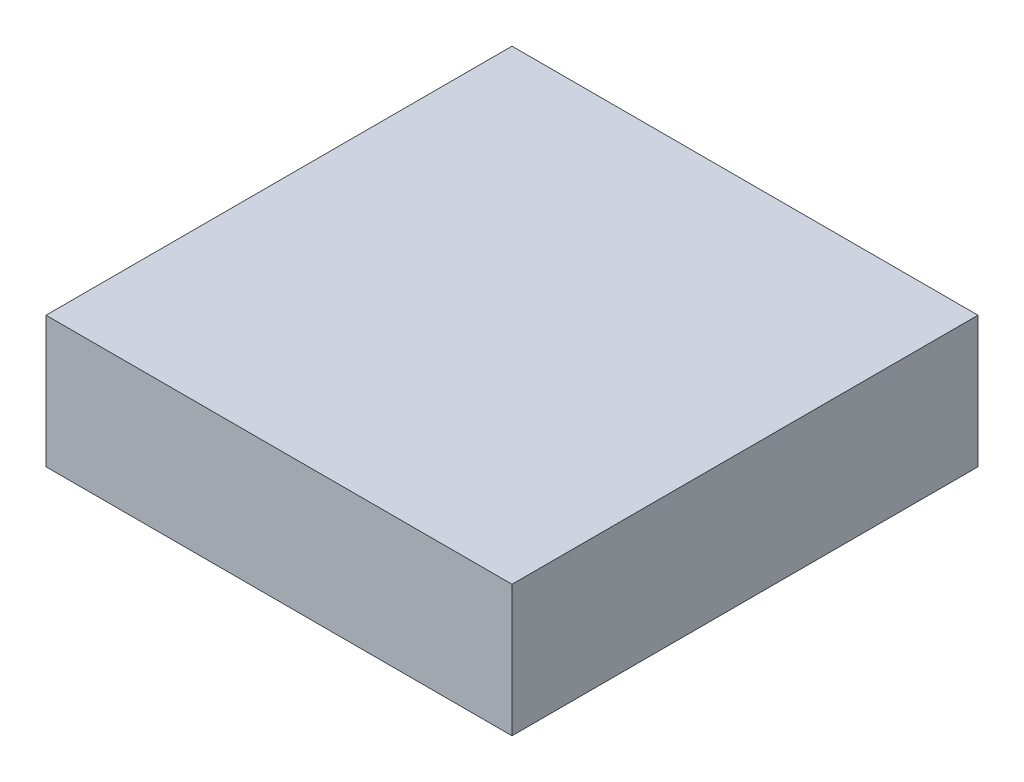
ISO-10303-21;
HEADER;
FILE_DESCRIPTION(('STEP AP214'),'2;1');
FILE_NAME('part.step','',(''),(''),'','','');
FILE_SCHEMA(('AUTOMOTIVE_DESIGN { 1 0 10303 214 1 1 1 1 }'));
ENDSEC;
DATA;
#1=APPLICATION_CONTEXT('core data for automotive mechanical design processes');
#2=APPLICATION_PROTOCOL_DEFINITION('international standard','automotive_design',2000,#1);
#3=PRODUCT_CONTEXT('',#1,'mechanical');
#4=PRODUCT('Part','Part','',(#3));
#5=PRODUCT_RELATED_PRODUCT_CATEGORY('part','',(#4));
#6=PRODUCT_DEFINITION_FORMATION('','',#4);
#7=PRODUCT_DEFINITION_CONTEXT('part definition',#1,'design');
#8=PRODUCT_DEFINITION('design','',#6,#7);
#9=PRODUCT_DEFINITION_SHAPE('','',#8);
#10=(LENGTH_UNIT() NAMED_UNIT(*) SI_UNIT(.MILLI.,.METRE.));
#11=(NAMED_UNIT(*) PLANE_ANGLE_UNIT() SI_UNIT($,.RADIAN.));
#12=(NAMED_UNIT(*) SI_UNIT($,.STERADIAN.) SOLID_ANGLE_UNIT());
#13=UNCERTAINTY_MEASURE_WITH_UNIT(LENGTH_MEASURE(1.E-05),#10,'distance_accuracy_value','');
#14=(GEOMETRIC_REPRESENTATION_CONTEXT(3) GLOBAL_UNCERTAINTY_ASSIGNED_CONTEXT((#13)) GLOBAL_UNIT_ASSIGNED_CONTEXT((#10,
#11,#12)) REPRESENTATION_CONTEXT('',''));
#15=CARTESIAN_POINT('',(0.,0.,0.));
#16=DIRECTION('',(0.,0.,1.));
#17=DIRECTION('',(1.,0.,0.));
#18=AXIS2_PLACEMENT_3D('',#15,#16,#17);
#19=CARTESIAN_POINT('',(-8.875,5.,-8.875));
#20=DIRECTION('',(1.,0.,0.));
#21=DIRECTION('',(0.,0.,-1.));
#22=AXIS2_PLACEMENT_3D('',#19,#20,#21);
#23=PLANE('',#22);
#24=DIRECTION('',(0.,0.,1.));
#25=VECTOR('',#24,1.);
#26=CARTESIAN_POINT('',(-8.875,0.,-8.875));
#27=LINE('',#26,#25);
#28=CARTESIAN_POINT('',(-8.875,0.,-8.875));
#29=VERTEX_POINT('',#28);
#30=CARTESIAN_POINT('',(-8.875,0.,8.875));
#31=VERTEX_POINT('',#30);
#32=EDGE_CURVE('E107',#29,#31,#27,.T.);
#33=ORIENTED_EDGE('',*,*,#32,.T.);
#34=DIRECTION('',(0.,-1.,0.));
#35=VECTOR('',#34,1.);
#36=CARTESIAN_POINT('',(-8.875,5.,8.875));
#37=LINE('',#36,#35);
#38=CARTESIAN_POINT('',(-8.875,5.,8.875));
#39=VERTEX_POINT('',#38);
#40=EDGE_CURVE('E11',#39,#31,#37,.T.);
#41=ORIENTED_EDGE('',*,*,#40,.F.);
#42=DIRECTION('',(0.,0.,1.));
#43=VECTOR('',#42,1.);
#44=CARTESIAN_POINT('',(-8.875,5.,-8.875));
#45=LINE('',#44,#43);
#46=CARTESIAN_POINT('',(-8.875,5.,-8.875));
#47=VERTEX_POINT('',#46);
#48=EDGE_CURVE('E91',#47,#39,#45,.T.);
#49=ORIENTED_EDGE('',*,*,#48,.F.);
#50=DIRECTION('',(0.,-1.,0.));
#51=VECTOR('',#50,1.);
#52=CARTESIAN_POINT('',(-8.875,5.,-8.875));
#53=LINE('',#52,#51);
#54=EDGE_CURVE('E103',#47,#29,#53,.T.);
#55=ORIENTED_EDGE('',*,*,#54,.T.);
#56=EDGE_LOOP('',(#33,#41,#49,#55));
#57=FACE_BOUND('',#56,.T.);
#58=ADVANCED_FACE('F39',(#57),#23,.F.);
#59=CARTESIAN_POINT('',(-8.875,5.,8.875));
#60=DIRECTION('',(0.,0.,-1.));
#61=DIRECTION('',(-1.,0.,0.));
#62=AXIS2_PLACEMENT_3D('',#59,#60,#61);
#63=PLANE('',#62);
#64=DIRECTION('',(1.,0.,0.));
#65=VECTOR('',#64,1.);
#66=CARTESIAN_POINT('',(-8.875,0.,8.875));
#67=LINE('',#66,#65);
#68=CARTESIAN_POINT('',(8.875,0.,8.875));
#69=VERTEX_POINT('',#68);
#70=EDGE_CURVE('E96',#31,#69,#67,.T.);
#71=ORIENTED_EDGE('',*,*,#70,.T.);
#72=DIRECTION('',(0.,-1.,0.));
#73=VECTOR('',#72,1.);
#74=CARTESIAN_POINT('',(8.875,5.,8.875));
#75=LINE('',#74,#73);
#76=CARTESIAN_POINT('',(8.875,5.,8.875));
#77=VERTEX_POINT('',#76);
#78=EDGE_CURVE('E48',#77,#69,#75,.T.);
#79=ORIENTED_EDGE('',*,*,#78,.F.);
#80=DIRECTION('',(1.,0.,0.));
#81=VECTOR('',#80,1.);
#82=CARTESIAN_POINT('',(-8.875,5.,8.875));
#83=LINE('',#82,#81);
#84=EDGE_CURVE('E86',#39,#77,#83,.T.);
#85=ORIENTED_EDGE('',*,*,#84,.F.);
#86=ORIENTED_EDGE('',*,*,#40,.T.);
#87=EDGE_LOOP('',(#71,#79,#85,#86));
#88=FACE_BOUND('',#87,.T.);
#89=ADVANCED_FACE('F95',(#88),#63,.F.);
#90=CARTESIAN_POINT('',(8.875,5.,-8.875));
#91=DIRECTION('',(-1.,0.,0.));
#92=DIRECTION('',(0.,0.,1.));
#93=AXIS2_PLACEMENT_3D('',#90,#91,#92);
#94=PLANE('',#93);
#95=DIRECTION('',(0.,0.,-1.));
#96=VECTOR('',#95,1.);
#97=CARTESIAN_POINT('',(8.875,0.,-8.875));
#98=LINE('',#97,#96);
#99=CARTESIAN_POINT('',(8.875,0.,-8.875));
#100=VERTEX_POINT('',#99);
#101=EDGE_CURVE('E73',#69,#100,#98,.T.);
#102=ORIENTED_EDGE('',*,*,#101,.T.);
#103=DIRECTION('',(0.,-1.,0.));
#104=VECTOR('',#103,1.);
#105=CARTESIAN_POINT('',(8.875,5.,-8.875));
#106=LINE('',#105,#104);
#107=CARTESIAN_POINT('',(8.875,5.,-8.875));
#108=VERTEX_POINT('',#107);
#109=EDGE_CURVE('E98',#108,#100,#106,.T.);
#110=ORIENTED_EDGE('',*,*,#109,.F.);
#111=DIRECTION('',(0.,0.,-1.));
#112=VECTOR('',#111,1.);
#113=CARTESIAN_POINT('',(8.875,5.,-8.875));
#114=LINE('',#113,#112);
#115=EDGE_CURVE('E89',#77,#108,#114,.T.);
#116=ORIENTED_EDGE('',*,*,#115,.F.);
#117=ORIENTED_EDGE('',*,*,#78,.T.);
#118=EDGE_LOOP('',(#102,#110,#116,#117));
#119=FACE_BOUND('',#118,.T.);
#120=ADVANCED_FACE('F99',(#119),#94,.F.);
#121=CARTESIAN_POINT('',(-8.875,5.,-8.875));
#122=DIRECTION('',(0.,0.,1.));
#123=DIRECTION('',(1.,0.,0.));
#124=AXIS2_PLACEMENT_3D('',#121,#122,#123);
#125=PLANE('',#124);
#126=DIRECTION('',(-1.,0.,0.));
#127=VECTOR('',#126,1.);
#128=CARTESIAN_POINT('',(-8.875,0.,-8.875));
#129=LINE('',#128,#127);
#130=EDGE_CURVE('E79',#100,#29,#129,.T.);
#131=ORIENTED_EDGE('',*,*,#130,.T.);
#132=ORIENTED_EDGE('',*,*,#54,.F.);
#133=DIRECTION('',(-1.,0.,0.));
#134=VECTOR('',#133,1.);
#135=CARTESIAN_POINT('',(-8.875,5.,-8.875));
#136=LINE('',#135,#134);
#137=EDGE_CURVE('E56',#108,#47,#136,.T.);
#138=ORIENTED_EDGE('',*,*,#137,.F.);
#139=ORIENTED_EDGE('',*,*,#109,.T.);
#140=EDGE_LOOP('',(#131,#132,#138,#139));
#141=FACE_BOUND('',#140,.T.);
#142=ADVANCED_FACE('F120',(#141),#125,.F.);
#143=CARTESIAN_POINT('',(0.,5.,0.));
#144=DIRECTION('',(0.,1.,0.));
#145=DIRECTION('',(0.,0.,1.));
#146=AXIS2_PLACEMENT_3D('',#143,#144,#145);
#147=PLANE('',#146);
#148=ORIENTED_EDGE('',*,*,#48,.T.);
#149=ORIENTED_EDGE('',*,*,#84,.T.);
#150=ORIENTED_EDGE('',*,*,#115,.T.);
#151=ORIENTED_EDGE('',*,*,#137,.T.);
#152=EDGE_LOOP('',(#148,#149,#150,#151));
#153=FACE_BOUND('',#152,.T.);
#154=ADVANCED_FACE('F87',(#153),#147,.T.);
#155=CARTESIAN_POINT('',(0.,0.,0.));
#156=DIRECTION('',(0.,1.,0.));
#157=DIRECTION('',(0.,0.,1.));
#158=AXIS2_PLACEMENT_3D('',#155,#156,#157);
#159=PLANE('',#158);
#160=ORIENTED_EDGE('',*,*,#32,.F.);
#161=ORIENTED_EDGE('',*,*,#130,.F.);
#162=ORIENTED_EDGE('',*,*,#101,.F.);
#163=ORIENTED_EDGE('',*,*,#70,.F.);
#164=EDGE_LOOP('',(#160,#161,#162,#163));
#165=FACE_BOUND('',#164,.T.);
#166=ADVANCED_FACE('F123',(#165),#159,.F.);
#167=CLOSED_SHELL('',(#58,#89,#120,#142,#154,#166));
#168=MANIFOLD_SOLID_BREP('B2',#167);
#169=ADVANCED_BREP_SHAPE_REPRESENTATION('',(#18,#168),#14);
#170=SHAPE_DEFINITION_REPRESENTATION(#9,#169);
ENDSEC;
END-ISO-10303-21;
